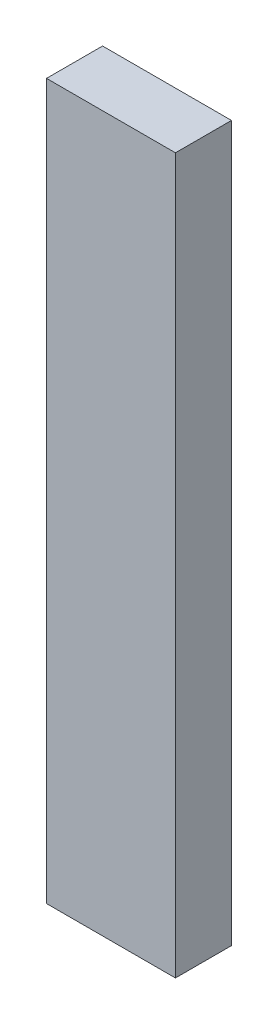
ISO-10303-21;
HEADER;
FILE_DESCRIPTION(('STEP AP214'),'2;1');
FILE_NAME('part.step','',(''),(''),'','','');
FILE_SCHEMA(('AUTOMOTIVE_DESIGN { 1 0 10303 214 1 1 1 1 }'));
ENDSEC;
DATA;
#1=APPLICATION_CONTEXT('core data for automotive mechanical design processes');
#2=APPLICATION_PROTOCOL_DEFINITION('international standard','automotive_design',2000,#1);
#3=PRODUCT_CONTEXT('',#1,'mechanical');
#4=PRODUCT('Part','Part','',(#3));
#5=PRODUCT_RELATED_PRODUCT_CATEGORY('part','',(#4));
#6=PRODUCT_DEFINITION_FORMATION('','',#4);
#7=PRODUCT_DEFINITION_CONTEXT('part definition',#1,'design');
#8=PRODUCT_DEFINITION('design','',#6,#7);
#9=PRODUCT_DEFINITION_SHAPE('','',#8);
#10=(LENGTH_UNIT() NAMED_UNIT(*) SI_UNIT(.MILLI.,.METRE.));
#11=(NAMED_UNIT(*) PLANE_ANGLE_UNIT() SI_UNIT($,.RADIAN.));
#12=(NAMED_UNIT(*) SI_UNIT($,.STERADIAN.) SOLID_ANGLE_UNIT());
#13=UNCERTAINTY_MEASURE_WITH_UNIT(LENGTH_MEASURE(1.E-05),#10,'distance_accuracy_value','');
#14=(GEOMETRIC_REPRESENTATION_CONTEXT(3) GLOBAL_UNCERTAINTY_ASSIGNED_CONTEXT((#13)) GLOBAL_UNIT_ASSIGNED_CONTEXT((#10,
#11,#12)) REPRESENTATION_CONTEXT('',''));
#15=CARTESIAN_POINT('',(0.,0.,0.));
#16=DIRECTION('',(0.,0.,1.));
#17=DIRECTION('',(1.,0.,0.));
#18=AXIS2_PLACEMENT_3D('',#15,#16,#17);
#19=CARTESIAN_POINT('',(23.,255.,10.));
#20=DIRECTION('',(-1.,0.,0.));
#21=DIRECTION('',(0.,0.,1.));
#22=AXIS2_PLACEMENT_3D('',#19,#20,#21);
#23=PLANE('',#22);
#24=DIRECTION('',(0.,0.,-1.));
#25=VECTOR('',#24,1.);
#26=CARTESIAN_POINT('',(23.,0.,10.));
#27=LINE('',#26,#25);
#28=CARTESIAN_POINT('',(23.,0.,10.));
#29=VERTEX_POINT('',#28);
#30=CARTESIAN_POINT('',(23.,0.,-10.));
#31=VERTEX_POINT('',#30);
#32=EDGE_CURVE('E96',#29,#31,#27,.T.);
#33=ORIENTED_EDGE('',*,*,#32,.T.);
#34=DIRECTION('',(0.,-1.,0.));
#35=VECTOR('',#34,1.);
#36=CARTESIAN_POINT('',(23.,255.,-10.));
#37=LINE('',#36,#35);
#38=CARTESIAN_POINT('',(23.,255.,-10.));
#39=VERTEX_POINT('',#38);
#40=EDGE_CURVE('E11',#39,#31,#37,.T.);
#41=ORIENTED_EDGE('',*,*,#40,.F.);
#42=DIRECTION('',(0.,0.,-1.));
#43=VECTOR('',#42,1.);
#44=CARTESIAN_POINT('',(23.,255.,10.));
#45=LINE('',#44,#43);
#46=CARTESIAN_POINT('',(23.,255.,10.));
#47=VERTEX_POINT('',#46);
#48=EDGE_CURVE('E84',#47,#39,#45,.T.);
#49=ORIENTED_EDGE('',*,*,#48,.F.);
#50=DIRECTION('',(0.,-1.,0.));
#51=VECTOR('',#50,1.);
#52=CARTESIAN_POINT('',(23.,255.,10.));
#53=LINE('',#52,#51);
#54=EDGE_CURVE('E92',#47,#29,#53,.T.);
#55=ORIENTED_EDGE('',*,*,#54,.T.);
#56=EDGE_LOOP('',(#33,#41,#49,#55));
#57=FACE_BOUND('',#56,.T.);
#58=ADVANCED_FACE('F33',(#57),#23,.F.);
#59=CARTESIAN_POINT('',(-23.,255.,-10.));
#60=DIRECTION('',(0.,0.,1.));
#61=DIRECTION('',(1.,0.,0.));
#62=AXIS2_PLACEMENT_3D('',#59,#60,#61);
#63=PLANE('',#62);
#64=DIRECTION('',(-1.,0.,0.));
#65=VECTOR('',#64,1.);
#66=CARTESIAN_POINT('',(-23.,0.,-10.));
#67=LINE('',#66,#65);
#68=CARTESIAN_POINT('',(-23.,0.,-10.));
#69=VERTEX_POINT('',#68);
#70=EDGE_CURVE('E88',#31,#69,#67,.T.);
#71=ORIENTED_EDGE('',*,*,#70,.T.);
#72=DIRECTION('',(0.,-1.,0.));
#73=VECTOR('',#72,1.);
#74=CARTESIAN_POINT('',(-23.,255.,-10.));
#75=LINE('',#74,#73);
#76=CARTESIAN_POINT('',(-23.,255.,-10.));
#77=VERTEX_POINT('',#76);
#78=EDGE_CURVE('E41',#77,#69,#75,.T.);
#79=ORIENTED_EDGE('',*,*,#78,.F.);
#80=DIRECTION('',(-1.,0.,0.));
#81=VECTOR('',#80,1.);
#82=CARTESIAN_POINT('',(-23.,255.,-10.));
#83=LINE('',#82,#81);
#84=EDGE_CURVE('E79',#39,#77,#83,.T.);
#85=ORIENTED_EDGE('',*,*,#84,.F.);
#86=ORIENTED_EDGE('',*,*,#40,.T.);
#87=EDGE_LOOP('',(#71,#79,#85,#86));
#88=FACE_BOUND('',#87,.T.);
#89=ADVANCED_FACE('F87',(#88),#63,.F.);
#90=CARTESIAN_POINT('',(-23.,255.,10.));
#91=DIRECTION('',(1.,0.,0.));
#92=DIRECTION('',(0.,0.,-1.));
#93=AXIS2_PLACEMENT_3D('',#90,#91,#92);
#94=PLANE('',#93);
#95=DIRECTION('',(0.,0.,1.));
#96=VECTOR('',#95,1.);
#97=CARTESIAN_POINT('',(-23.,0.,10.));
#98=LINE('',#97,#96);
#99=CARTESIAN_POINT('',(-23.,0.,10.));
#100=VERTEX_POINT('',#99);
#101=EDGE_CURVE('E66',#69,#100,#98,.T.);
#102=ORIENTED_EDGE('',*,*,#101,.T.);
#103=DIRECTION('',(0.,-1.,0.));
#104=VECTOR('',#103,1.);
#105=CARTESIAN_POINT('',(-23.,255.,10.));
#106=LINE('',#105,#104);
#107=CARTESIAN_POINT('',(-23.,255.,10.));
#108=VERTEX_POINT('',#107);
#109=EDGE_CURVE('E89',#108,#100,#106,.T.);
#110=ORIENTED_EDGE('',*,*,#109,.F.);
#111=DIRECTION('',(0.,0.,1.));
#112=VECTOR('',#111,1.);
#113=CARTESIAN_POINT('',(-23.,255.,10.));
#114=LINE('',#113,#112);
#115=EDGE_CURVE('E82',#77,#108,#114,.T.);
#116=ORIENTED_EDGE('',*,*,#115,.F.);
#117=ORIENTED_EDGE('',*,*,#78,.T.);
#118=EDGE_LOOP('',(#102,#110,#116,#117));
#119=FACE_BOUND('',#118,.T.);
#120=ADVANCED_FACE('F90',(#119),#94,.F.);
#121=CARTESIAN_POINT('',(-23.,255.,10.));
#122=DIRECTION('',(0.,0.,-1.));
#123=DIRECTION('',(-1.,0.,0.));
#124=AXIS2_PLACEMENT_3D('',#121,#122,#123);
#125=PLANE('',#124);
#126=DIRECTION('',(1.,0.,0.));
#127=VECTOR('',#126,1.);
#128=CARTESIAN_POINT('',(-23.,0.,10.));
#129=LINE('',#128,#127);
#130=EDGE_CURVE('E72',#100,#29,#129,.T.);
#131=ORIENTED_EDGE('',*,*,#130,.T.);
#132=ORIENTED_EDGE('',*,*,#54,.F.);
#133=DIRECTION('',(1.,0.,0.));
#134=VECTOR('',#133,1.);
#135=CARTESIAN_POINT('',(-23.,255.,10.));
#136=LINE('',#135,#134);
#137=EDGE_CURVE('E49',#108,#47,#136,.T.);
#138=ORIENTED_EDGE('',*,*,#137,.F.);
#139=ORIENTED_EDGE('',*,*,#109,.T.);
#140=EDGE_LOOP('',(#131,#132,#138,#139));
#141=FACE_BOUND('',#140,.T.);
#142=ADVANCED_FACE('F103',(#141),#125,.F.);
#143=CARTESIAN_POINT('',(0.,255.,0.));
#144=DIRECTION('',(0.,-1.,0.));
#145=DIRECTION('',(0.,0.,-1.));
#146=AXIS2_PLACEMENT_3D('',#143,#144,#145);
#147=PLANE('',#146);
#148=ORIENTED_EDGE('',*,*,#48,.T.);
#149=ORIENTED_EDGE('',*,*,#84,.T.);
#150=ORIENTED_EDGE('',*,*,#115,.T.);
#151=ORIENTED_EDGE('',*,*,#137,.T.);
#152=EDGE_LOOP('',(#148,#149,#150,#151));
#153=FACE_BOUND('',#152,.T.);
#154=ADVANCED_FACE('F80',(#153),#147,.F.);
#155=CARTESIAN_POINT('',(0.,0.,0.));
#156=DIRECTION('',(0.,-1.,0.));
#157=DIRECTION('',(0.,0.,-1.));
#158=AXIS2_PLACEMENT_3D('',#155,#156,#157);
#159=PLANE('',#158);
#160=ORIENTED_EDGE('',*,*,#32,.F.);
#161=ORIENTED_EDGE('',*,*,#130,.F.);
#162=ORIENTED_EDGE('',*,*,#101,.F.);
#163=ORIENTED_EDGE('',*,*,#70,.F.);
#164=EDGE_LOOP('',(#160,#161,#162,#163));
#165=FACE_BOUND('',#164,.T.);
#166=ADVANCED_FACE('F106',(#165),#159,.T.);
#167=CLOSED_SHELL('',(#58,#89,#120,#142,#154,#166));
#168=MANIFOLD_SOLID_BREP('B2',#167);
#169=ADVANCED_BREP_SHAPE_REPRESENTATION('',(#18,#168),#14);
#170=SHAPE_DEFINITION_REPRESENTATION(#9,#169);
ENDSEC;
END-ISO-10303-21;
